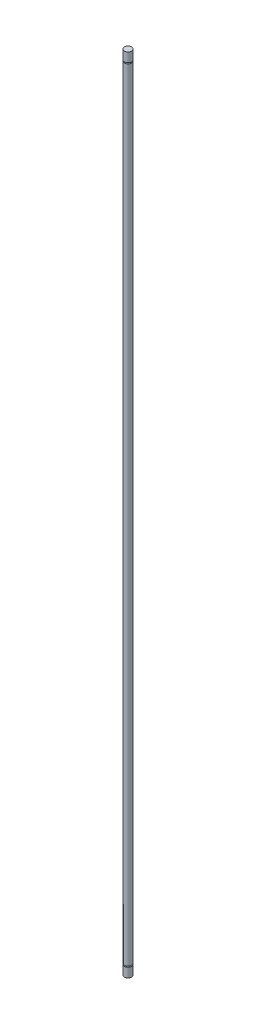
ISO-10303-21;
HEADER;
FILE_DESCRIPTION(('STEP AP214'),'2;1');
FILE_NAME('part.step','',(''),(''),'','','');
FILE_SCHEMA(('AUTOMOTIVE_DESIGN { 1 0 10303 214 1 1 1 1 }'));
ENDSEC;
DATA;
#1=APPLICATION_CONTEXT('core data for automotive mechanical design processes');
#2=APPLICATION_PROTOCOL_DEFINITION('international standard','automotive_design',2000,#1);
#3=PRODUCT_CONTEXT('',#1,'mechanical');
#4=PRODUCT('Part','Part','',(#3));
#5=PRODUCT_RELATED_PRODUCT_CATEGORY('part','',(#4));
#6=PRODUCT_DEFINITION_FORMATION('','',#4);
#7=PRODUCT_DEFINITION_CONTEXT('part definition',#1,'design');
#8=PRODUCT_DEFINITION('design','',#6,#7);
#9=PRODUCT_DEFINITION_SHAPE('','',#8);
#10=(LENGTH_UNIT() NAMED_UNIT(*) SI_UNIT(.MILLI.,.METRE.));
#11=(NAMED_UNIT(*) PLANE_ANGLE_UNIT() SI_UNIT($,.RADIAN.));
#12=(NAMED_UNIT(*) SI_UNIT($,.STERADIAN.) SOLID_ANGLE_UNIT());
#13=UNCERTAINTY_MEASURE_WITH_UNIT(LENGTH_MEASURE(1.E-05),#10,'distance_accuracy_value','');
#14=(GEOMETRIC_REPRESENTATION_CONTEXT(3) GLOBAL_UNCERTAINTY_ASSIGNED_CONTEXT((#13)) GLOBAL_UNIT_ASSIGNED_CONTEXT((#10,
#11,#12)) REPRESENTATION_CONTEXT('',''));
#15=CARTESIAN_POINT('',(0.,0.,0.));
#16=DIRECTION('',(0.,0.,1.));
#17=DIRECTION('',(1.,0.,0.));
#18=AXIS2_PLACEMENT_3D('',#15,#16,#17);
#19=CARTESIAN_POINT('',(0.,260.35,0.));
#20=DIRECTION('',(0.,-1.,0.));
#21=DIRECTION('',(0.,0.,-1.));
#22=AXIS2_PLACEMENT_3D('',#19,#20,#21);
#23=CYLINDRICAL_SURFACE('',#22,2.38125);
#24=CARTESIAN_POINT('',(0.,253.6825,0.));
#25=DIRECTION('',(0.,-1.,0.));
#26=DIRECTION('',(0.,0.,-1.));
#27=AXIS2_PLACEMENT_3D('',#24,#25,#26);
#28=CIRCLE('',#27,2.38125);
#29=CARTESIAN_POINT('',(0.,253.6825,-2.38125));
#30=VERTEX_POINT('',#29);
#31=EDGE_CURVE('E11',#30,#30,#28,.T.);
#32=ORIENTED_EDGE('',*,*,#31,.T.);
#33=EDGE_LOOP('',(#32));
#34=FACE_BOUND('',#33,.T.);
#35=CARTESIAN_POINT('',(0.,-253.6825,0.));
#36=DIRECTION('',(0.,1.,0.));
#37=DIRECTION('',(0.,0.,1.));
#38=AXIS2_PLACEMENT_3D('',#35,#36,#37);
#39=CIRCLE('',#38,2.38125);
#40=CARTESIAN_POINT('',(0.,-253.6825,-2.38125));
#41=VERTEX_POINT('',#40);
#42=EDGE_CURVE('E112',#41,#41,#39,.T.);
#43=ORIENTED_EDGE('',*,*,#42,.T.);
#44=EDGE_LOOP('',(#43));
#45=FACE_BOUND('',#44,.T.);
#46=ADVANCED_FACE('F36',(#34,#45),#23,.T.);
#47=CARTESIAN_POINT('',(0.,-253.6825,-1.5494));
#48=DIRECTION('',(0.,1.,0.));
#49=DIRECTION('',(0.,0.,1.));
#50=AXIS2_PLACEMENT_3D('',#47,#48,#49);
#51=PLANE('',#50);
#52=ORIENTED_EDGE('',*,*,#42,.F.);
#53=EDGE_LOOP('',(#52));
#54=FACE_BOUND('',#53,.T.);
#55=CARTESIAN_POINT('',(0.,-253.6825,0.));
#56=DIRECTION('',(0.,-1.,0.));
#57=DIRECTION('',(0.,0.,-1.));
#58=AXIS2_PLACEMENT_3D('',#55,#56,#57);
#59=CIRCLE('',#58,1.5494);
#60=CARTESIAN_POINT('',(0.,-253.6825,-1.5494));
#61=VERTEX_POINT('',#60);
#62=EDGE_CURVE('E98',#61,#61,#59,.T.);
#63=ORIENTED_EDGE('',*,*,#62,.F.);
#64=EDGE_LOOP('',(#63));
#65=FACE_BOUND('',#64,.T.);
#66=ADVANCED_FACE('F129',(#54,#65),#51,.F.);
#67=CARTESIAN_POINT('',(0.,-254.3175,-1.5494));
#68=DIRECTION('',(0.,-1.,0.));
#69=DIRECTION('',(0.,0.,-1.));
#70=AXIS2_PLACEMENT_3D('',#67,#68,#69);
#71=PLANE('',#70);
#72=CARTESIAN_POINT('',(0.,-254.3175,0.));
#73=DIRECTION('',(0.,-1.,0.));
#74=DIRECTION('',(0.,0.,-1.));
#75=AXIS2_PLACEMENT_3D('',#72,#73,#74);
#76=CIRCLE('',#75,2.38125);
#77=CARTESIAN_POINT('',(0.,-254.3175,-2.38125));
#78=VERTEX_POINT('',#77);
#79=EDGE_CURVE('E107',#78,#78,#76,.T.);
#80=ORIENTED_EDGE('',*,*,#79,.F.);
#81=EDGE_LOOP('',(#80));
#82=FACE_BOUND('',#81,.T.);
#83=CARTESIAN_POINT('',(0.,-254.3175,0.));
#84=DIRECTION('',(0.,-1.,0.));
#85=DIRECTION('',(0.,0.,-1.));
#86=AXIS2_PLACEMENT_3D('',#83,#84,#85);
#87=CIRCLE('',#86,1.5494);
#88=CARTESIAN_POINT('',(0.,-254.3175,-1.5494));
#89=VERTEX_POINT('',#88);
#90=EDGE_CURVE('E95',#89,#89,#87,.T.);
#91=ORIENTED_EDGE('',*,*,#90,.T.);
#92=EDGE_LOOP('',(#91));
#93=FACE_BOUND('',#92,.T.);
#94=ADVANCED_FACE('F134',(#82,#93),#71,.F.);
#95=CARTESIAN_POINT('',(0.,-254.,0.));
#96=DIRECTION('',(0.,-1.,0.));
#97=DIRECTION('',(0.,0.,-1.));
#98=AXIS2_PLACEMENT_3D('',#95,#96,#97);
#99=CYLINDRICAL_SURFACE('',#98,1.5494);
#100=DIRECTION('',(0.,-1.,0.));
#101=VECTOR('',#100,1.);
#102=CARTESIAN_POINT('',(0.,-253.6825,-1.5494));
#103=LINE('',#102,#101);
#104=EDGE_CURVE('E87',#61,#89,#103,.T.);
#105=ORIENTED_EDGE('',*,*,#104,.T.);
#106=ORIENTED_EDGE('',*,*,#90,.F.);
#107=ORIENTED_EDGE('',*,*,#104,.F.);
#108=ORIENTED_EDGE('',*,*,#62,.T.);
#109=EDGE_LOOP('',(#105,#106,#107,#108));
#110=FACE_BOUND('',#109,.T.);
#111=ADVANCED_FACE('F146',(#110),#99,.T.);
#112=CARTESIAN_POINT('',(0.,-260.35,0.));
#113=DIRECTION('',(0.,1.,0.));
#114=DIRECTION('',(0.,0.,1.));
#115=AXIS2_PLACEMENT_3D('',#112,#113,#114);
#116=PLANE('',#115);
#117=CARTESIAN_POINT('',(0.,-260.35,0.));
#118=DIRECTION('',(0.,1.,0.));
#119=DIRECTION('',(0.,0.,1.));
#120=AXIS2_PLACEMENT_3D('',#117,#118,#119);
#121=CIRCLE('',#120,2.38125);
#122=CARTESIAN_POINT('',(0.,-260.35,2.38125));
#123=VERTEX_POINT('',#122);
#124=EDGE_CURVE('E97',#123,#123,#121,.T.);
#125=ORIENTED_EDGE('',*,*,#124,.F.);
#126=EDGE_LOOP('',(#125));
#127=FACE_BOUND('',#126,.T.);
#128=ADVANCED_FACE('F139',(#127),#116,.F.);
#129=ORIENTED_EDGE('',*,*,#79,.T.);
#130=EDGE_LOOP('',(#129));
#131=FACE_BOUND('',#130,.T.);
#132=ORIENTED_EDGE('',*,*,#124,.T.);
#133=EDGE_LOOP('',(#132));
#134=FACE_BOUND('',#133,.T.);
#135=ADVANCED_FACE('F38',(#131,#134),#23,.T.);
#136=CARTESIAN_POINT('',(0.,253.6825,-1.5494));
#137=DIRECTION('',(0.,-1.,0.));
#138=DIRECTION('',(0.,0.,-1.));
#139=AXIS2_PLACEMENT_3D('',#136,#137,#138);
#140=PLANE('',#139);
#141=ORIENTED_EDGE('',*,*,#31,.F.);
#142=EDGE_LOOP('',(#141));
#143=FACE_BOUND('',#142,.T.);
#144=CARTESIAN_POINT('',(0.,253.6825,0.));
#145=DIRECTION('',(0.,-1.,0.));
#146=DIRECTION('',(0.,0.,-1.));
#147=AXIS2_PLACEMENT_3D('',#144,#145,#146);
#148=CIRCLE('',#147,1.5494);
#149=CARTESIAN_POINT('',(0.,253.6825,-1.5494));
#150=VERTEX_POINT('',#149);
#151=EDGE_CURVE('E85',#150,#150,#148,.T.);
#152=ORIENTED_EDGE('',*,*,#151,.T.);
#153=EDGE_LOOP('',(#152));
#154=FACE_BOUND('',#153,.T.);
#155=ADVANCED_FACE('F138',(#143,#154),#140,.F.);
#156=CARTESIAN_POINT('',(0.,254.3175,-1.5494));
#157=DIRECTION('',(0.,1.,0.));
#158=DIRECTION('',(0.,0.,1.));
#159=AXIS2_PLACEMENT_3D('',#156,#157,#158);
#160=PLANE('',#159);
#161=CARTESIAN_POINT('',(0.,254.3175,0.));
#162=DIRECTION('',(0.,1.,0.));
#163=DIRECTION('',(0.,0.,1.));
#164=AXIS2_PLACEMENT_3D('',#161,#162,#163);
#165=CIRCLE('',#164,2.38125);
#166=CARTESIAN_POINT('',(0.,254.3175,-2.38125));
#167=VERTEX_POINT('',#166);
#168=EDGE_CURVE('E44',#167,#167,#165,.T.);
#169=ORIENTED_EDGE('',*,*,#168,.F.);
#170=EDGE_LOOP('',(#169));
#171=FACE_BOUND('',#170,.T.);
#172=CARTESIAN_POINT('',(0.,254.3175,0.));
#173=DIRECTION('',(0.,-1.,0.));
#174=DIRECTION('',(0.,0.,-1.));
#175=AXIS2_PLACEMENT_3D('',#172,#173,#174);
#176=CIRCLE('',#175,1.5494);
#177=CARTESIAN_POINT('',(0.,254.3175,-1.5494));
#178=VERTEX_POINT('',#177);
#179=EDGE_CURVE('E76',#178,#178,#176,.T.);
#180=ORIENTED_EDGE('',*,*,#179,.F.);
#181=EDGE_LOOP('',(#180));
#182=FACE_BOUND('',#181,.T.);
#183=ADVANCED_FACE('F75',(#171,#182),#160,.F.);
#184=CARTESIAN_POINT('',(0.,254.,0.));
#185=DIRECTION('',(0.,-1.,0.));
#186=DIRECTION('',(0.,0.,-1.));
#187=AXIS2_PLACEMENT_3D('',#184,#185,#186);
#188=CYLINDRICAL_SURFACE('',#187,1.5494);
#189=DIRECTION('',(0.,1.,0.));
#190=VECTOR('',#189,1.);
#191=CARTESIAN_POINT('',(0.,253.6825,-1.5494));
#192=LINE('',#191,#190);
#193=EDGE_CURVE('E79',#178,#150,#192,.F.);
#194=ORIENTED_EDGE('',*,*,#193,.T.);
#195=ORIENTED_EDGE('',*,*,#151,.F.);
#196=ORIENTED_EDGE('',*,*,#193,.F.);
#197=ORIENTED_EDGE('',*,*,#179,.T.);
#198=EDGE_LOOP('',(#194,#195,#196,#197));
#199=FACE_BOUND('',#198,.T.);
#200=ADVANCED_FACE('F83',(#199),#188,.T.);
#201=CARTESIAN_POINT('',(0.,260.35,0.));
#202=DIRECTION('',(0.,1.,0.));
#203=DIRECTION('',(0.,0.,1.));
#204=AXIS2_PLACEMENT_3D('',#201,#202,#203);
#205=PLANE('',#204);
#206=CARTESIAN_POINT('',(0.,260.35,0.));
#207=DIRECTION('',(0.,1.,0.));
#208=DIRECTION('',(0.,0.,1.));
#209=AXIS2_PLACEMENT_3D('',#206,#207,#208);
#210=CIRCLE('',#209,2.38125);
#211=CARTESIAN_POINT('',(0.,260.35,2.38125));
#212=VERTEX_POINT('',#211);
#213=EDGE_CURVE('E104',#212,#212,#210,.T.);
#214=ORIENTED_EDGE('',*,*,#213,.T.);
#215=EDGE_LOOP('',(#214));
#216=FACE_BOUND('',#215,.T.);
#217=ADVANCED_FACE('F118',(#216),#205,.T.);
#218=ORIENTED_EDGE('',*,*,#168,.T.);
#219=EDGE_LOOP('',(#218));
#220=FACE_BOUND('',#219,.T.);
#221=ORIENTED_EDGE('',*,*,#213,.F.);
#222=EDGE_LOOP('',(#221));
#223=FACE_BOUND('',#222,.T.);
#224=ADVANCED_FACE('F115',(#220,#223),#23,.T.);
#225=CLOSED_SHELL('',(#46,#66,#94,#111,#128,#135,#155,#183,#200,#217,#224));
#226=MANIFOLD_SOLID_BREP('B2',#225);
#227=ADVANCED_BREP_SHAPE_REPRESENTATION('',(#18,#226),#14);
#228=SHAPE_DEFINITION_REPRESENTATION(#9,#227);
ENDSEC;
END-ISO-10303-21;
